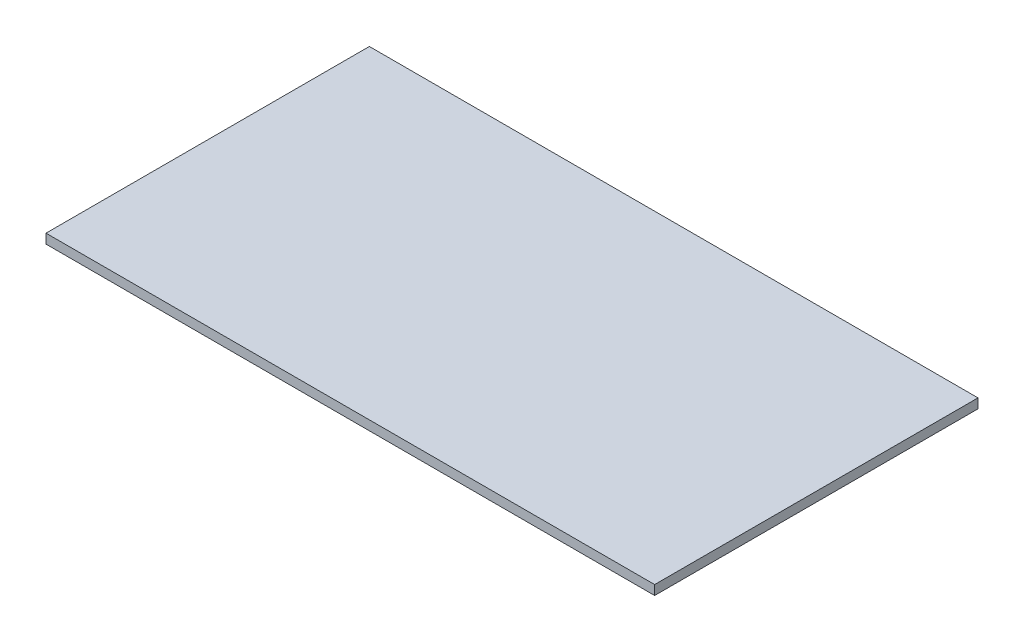
ISO-10303-21;
HEADER;
FILE_DESCRIPTION(('STEP AP214'),'2;1');
FILE_NAME('part.step','',(''),(''),'','','');
FILE_SCHEMA(('AUTOMOTIVE_DESIGN { 1 0 10303 214 1 1 1 1 }'));
ENDSEC;
DATA;
#1=APPLICATION_CONTEXT('core data for automotive mechanical design processes');
#2=APPLICATION_PROTOCOL_DEFINITION('international standard','automotive_design',2000,#1);
#3=PRODUCT_CONTEXT('',#1,'mechanical');
#4=PRODUCT('Part','Part','',(#3));
#5=PRODUCT_RELATED_PRODUCT_CATEGORY('part','',(#4));
#6=PRODUCT_DEFINITION_FORMATION('','',#4);
#7=PRODUCT_DEFINITION_CONTEXT('part definition',#1,'design');
#8=PRODUCT_DEFINITION('design','',#6,#7);
#9=PRODUCT_DEFINITION_SHAPE('','',#8);
#10=(LENGTH_UNIT() NAMED_UNIT(*) SI_UNIT(.MILLI.,.METRE.));
#11=(NAMED_UNIT(*) PLANE_ANGLE_UNIT() SI_UNIT($,.RADIAN.));
#12=(NAMED_UNIT(*) SI_UNIT($,.STERADIAN.) SOLID_ANGLE_UNIT());
#13=UNCERTAINTY_MEASURE_WITH_UNIT(LENGTH_MEASURE(1.E-05),#10,'distance_accuracy_value','');
#14=(GEOMETRIC_REPRESENTATION_CONTEXT(3) GLOBAL_UNCERTAINTY_ASSIGNED_CONTEXT((#13)) GLOBAL_UNIT_ASSIGNED_CONTEXT((#10,
#11,#12)) REPRESENTATION_CONTEXT('',''));
#15=CARTESIAN_POINT('',(0.,0.,0.));
#16=DIRECTION('',(0.,0.,1.));
#17=DIRECTION('',(1.,0.,0.));
#18=AXIS2_PLACEMENT_3D('',#15,#16,#17);
#19=CARTESIAN_POINT('',(480.,7.50000000000001,255.));
#20=DIRECTION('',(-1.,0.,0.));
#21=DIRECTION('',(0.,0.,1.));
#22=AXIS2_PLACEMENT_3D('',#19,#20,#21);
#23=PLANE('',#22);
#24=DIRECTION('',(0.,0.,-1.));
#25=VECTOR('',#24,1.);
#26=CARTESIAN_POINT('',(480.,-7.50000000000001,255.));
#27=LINE('',#26,#25);
#28=CARTESIAN_POINT('',(480.,-7.50000000000001,255.));
#29=VERTEX_POINT('',#28);
#30=CARTESIAN_POINT('',(480.,-7.50000000000001,-255.));
#31=VERTEX_POINT('',#30);
#32=EDGE_CURVE('E99',#29,#31,#27,.T.);
#33=ORIENTED_EDGE('',*,*,#32,.T.);
#34=DIRECTION('',(0.,-1.,0.));
#35=VECTOR('',#34,1.);
#36=CARTESIAN_POINT('',(480.,7.49999999999998,-255.));
#37=LINE('',#36,#35);
#38=CARTESIAN_POINT('',(480.,7.49999999999998,-255.));
#39=VERTEX_POINT('',#38);
#40=EDGE_CURVE('E11',#39,#31,#37,.T.);
#41=ORIENTED_EDGE('',*,*,#40,.F.);
#42=DIRECTION('',(0.,0.,-1.));
#43=VECTOR('',#42,1.);
#44=CARTESIAN_POINT('',(480.,7.50000000000001,255.));
#45=LINE('',#44,#43);
#46=CARTESIAN_POINT('',(480.,7.50000000000001,255.));
#47=VERTEX_POINT('',#46);
#48=EDGE_CURVE('E87',#47,#39,#45,.T.);
#49=ORIENTED_EDGE('',*,*,#48,.F.);
#50=DIRECTION('',(0.,-1.,0.));
#51=VECTOR('',#50,1.);
#52=CARTESIAN_POINT('',(480.,7.50000000000001,255.));
#53=LINE('',#52,#51);
#54=EDGE_CURVE('E95',#47,#29,#53,.T.);
#55=ORIENTED_EDGE('',*,*,#54,.T.);
#56=EDGE_LOOP('',(#33,#41,#49,#55));
#57=FACE_BOUND('',#56,.T.);
#58=ADVANCED_FACE('F36',(#57),#23,.F.);
#59=CARTESIAN_POINT('',(-480.,7.50000000000001,-255.));
#60=DIRECTION('',(0.,0.,1.));
#61=DIRECTION('',(1.,0.,0.));
#62=AXIS2_PLACEMENT_3D('',#59,#60,#61);
#63=PLANE('',#62);
#64=DIRECTION('',(-1.,0.,0.));
#65=VECTOR('',#64,1.);
#66=CARTESIAN_POINT('',(-480.,-7.49999999999999,-255.));
#67=LINE('',#66,#65);
#68=CARTESIAN_POINT('',(-480.,-7.49999999999999,-255.));
#69=VERTEX_POINT('',#68);
#70=EDGE_CURVE('E91',#31,#69,#67,.T.);
#71=ORIENTED_EDGE('',*,*,#70,.T.);
#72=DIRECTION('',(0.,-1.,0.));
#73=VECTOR('',#72,1.);
#74=CARTESIAN_POINT('',(-480.,7.50000000000001,-255.));
#75=LINE('',#74,#73);
#76=CARTESIAN_POINT('',(-480.,7.50000000000001,-255.));
#77=VERTEX_POINT('',#76);
#78=EDGE_CURVE('E44',#77,#69,#75,.T.);
#79=ORIENTED_EDGE('',*,*,#78,.F.);
#80=DIRECTION('',(-1.,0.,0.));
#81=VECTOR('',#80,1.);
#82=CARTESIAN_POINT('',(-480.,7.50000000000001,-255.));
#83=LINE('',#82,#81);
#84=EDGE_CURVE('E82',#39,#77,#83,.T.);
#85=ORIENTED_EDGE('',*,*,#84,.F.);
#86=ORIENTED_EDGE('',*,*,#40,.T.);
#87=EDGE_LOOP('',(#71,#79,#85,#86));
#88=FACE_BOUND('',#87,.T.);
#89=ADVANCED_FACE('F90',(#88),#63,.F.);
#90=CARTESIAN_POINT('',(-480.,7.50000000000001,255.));
#91=DIRECTION('',(1.,0.,0.));
#92=DIRECTION('',(0.,0.,-1.));
#93=AXIS2_PLACEMENT_3D('',#90,#91,#92);
#94=PLANE('',#93);
#95=DIRECTION('',(0.,0.,1.));
#96=VECTOR('',#95,1.);
#97=CARTESIAN_POINT('',(-480.,-7.49999999999999,255.));
#98=LINE('',#97,#96);
#99=CARTESIAN_POINT('',(-480.,-7.49999999999999,255.));
#100=VERTEX_POINT('',#99);
#101=EDGE_CURVE('E69',#69,#100,#98,.T.);
#102=ORIENTED_EDGE('',*,*,#101,.T.);
#103=DIRECTION('',(0.,-1.,0.));
#104=VECTOR('',#103,1.);
#105=CARTESIAN_POINT('',(-480.,7.50000000000001,255.));
#106=LINE('',#105,#104);
#107=CARTESIAN_POINT('',(-480.,7.50000000000001,255.));
#108=VERTEX_POINT('',#107);
#109=EDGE_CURVE('E92',#108,#100,#106,.T.);
#110=ORIENTED_EDGE('',*,*,#109,.F.);
#111=DIRECTION('',(0.,0.,1.));
#112=VECTOR('',#111,1.);
#113=CARTESIAN_POINT('',(-480.,7.50000000000001,255.));
#114=LINE('',#113,#112);
#115=EDGE_CURVE('E85',#77,#108,#114,.T.);
#116=ORIENTED_EDGE('',*,*,#115,.F.);
#117=ORIENTED_EDGE('',*,*,#78,.T.);
#118=EDGE_LOOP('',(#102,#110,#116,#117));
#119=FACE_BOUND('',#118,.T.);
#120=ADVANCED_FACE('F93',(#119),#94,.F.);
#121=CARTESIAN_POINT('',(-480.,7.50000000000001,255.));
#122=DIRECTION('',(0.,0.,-1.));
#123=DIRECTION('',(-1.,0.,0.));
#124=AXIS2_PLACEMENT_3D('',#121,#122,#123);
#125=PLANE('',#124);
#126=DIRECTION('',(1.,0.,0.));
#127=VECTOR('',#126,1.);
#128=CARTESIAN_POINT('',(-480.,-7.49999999999999,255.));
#129=LINE('',#128,#127);
#130=EDGE_CURVE('E75',#100,#29,#129,.T.);
#131=ORIENTED_EDGE('',*,*,#130,.T.);
#132=ORIENTED_EDGE('',*,*,#54,.F.);
#133=DIRECTION('',(1.,0.,0.));
#134=VECTOR('',#133,1.);
#135=CARTESIAN_POINT('',(-480.,7.50000000000001,255.));
#136=LINE('',#135,#134);
#137=EDGE_CURVE('E52',#108,#47,#136,.T.);
#138=ORIENTED_EDGE('',*,*,#137,.F.);
#139=ORIENTED_EDGE('',*,*,#109,.T.);
#140=EDGE_LOOP('',(#131,#132,#138,#139));
#141=FACE_BOUND('',#140,.T.);
#142=ADVANCED_FACE('F106',(#141),#125,.F.);
#143=CARTESIAN_POINT('',(0.,7.50000000000001,0.));
#144=DIRECTION('',(0.,-1.,0.));
#145=DIRECTION('',(0.,0.,-1.));
#146=AXIS2_PLACEMENT_3D('',#143,#144,#145);
#147=PLANE('',#146);
#148=ORIENTED_EDGE('',*,*,#48,.T.);
#149=ORIENTED_EDGE('',*,*,#84,.T.);
#150=ORIENTED_EDGE('',*,*,#115,.T.);
#151=ORIENTED_EDGE('',*,*,#137,.T.);
#152=EDGE_LOOP('',(#148,#149,#150,#151));
#153=FACE_BOUND('',#152,.T.);
#154=ADVANCED_FACE('F83',(#153),#147,.F.);
#155=CARTESIAN_POINT('',(0.,-7.50000000000001,0.));
#156=DIRECTION('',(0.,-1.,0.));
#157=DIRECTION('',(0.,0.,-1.));
#158=AXIS2_PLACEMENT_3D('',#155,#156,#157);
#159=PLANE('',#158);
#160=ORIENTED_EDGE('',*,*,#32,.F.);
#161=ORIENTED_EDGE('',*,*,#130,.F.);
#162=ORIENTED_EDGE('',*,*,#101,.F.);
#163=ORIENTED_EDGE('',*,*,#70,.F.);
#164=EDGE_LOOP('',(#160,#161,#162,#163));
#165=FACE_BOUND('',#164,.T.);
#166=ADVANCED_FACE('F109',(#165),#159,.T.);
#167=CLOSED_SHELL('',(#58,#89,#120,#142,#154,#166));
#168=MANIFOLD_SOLID_BREP('B2',#167);
#169=ADVANCED_BREP_SHAPE_REPRESENTATION('',(#18,#168),#14);
#170=SHAPE_DEFINITION_REPRESENTATION(#9,#169);
ENDSEC;
END-ISO-10303-21;
